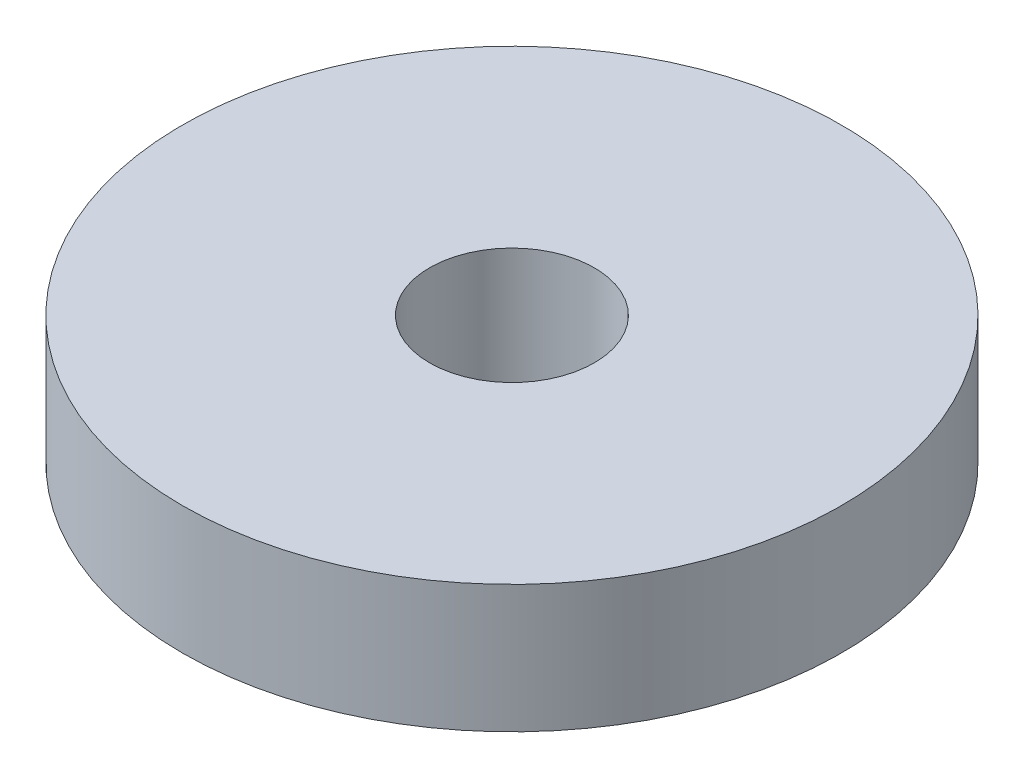
ISO-10303-21;
HEADER;
FILE_DESCRIPTION(('STEP AP214'),'2;1');
FILE_NAME('part.step','',(''),(''),'','','');
FILE_SCHEMA(('AUTOMOTIVE_DESIGN { 1 0 10303 214 1 1 1 1 }'));
ENDSEC;
DATA;
#1=APPLICATION_CONTEXT('core data for automotive mechanical design processes');
#2=APPLICATION_PROTOCOL_DEFINITION('international standard','automotive_design',2000,#1);
#3=PRODUCT_CONTEXT('',#1,'mechanical');
#4=PRODUCT('Part','Part','',(#3));
#5=PRODUCT_RELATED_PRODUCT_CATEGORY('part','',(#4));
#6=PRODUCT_DEFINITION_FORMATION('','',#4);
#7=PRODUCT_DEFINITION_CONTEXT('part definition',#1,'design');
#8=PRODUCT_DEFINITION('design','',#6,#7);
#9=PRODUCT_DEFINITION_SHAPE('','',#8);
#10=(LENGTH_UNIT() NAMED_UNIT(*) SI_UNIT(.MILLI.,.METRE.));
#11=(NAMED_UNIT(*) PLANE_ANGLE_UNIT() SI_UNIT($,.RADIAN.));
#12=(NAMED_UNIT(*) SI_UNIT($,.STERADIAN.) SOLID_ANGLE_UNIT());
#13=UNCERTAINTY_MEASURE_WITH_UNIT(LENGTH_MEASURE(1.E-05),#10,'distance_accuracy_value','');
#14=(GEOMETRIC_REPRESENTATION_CONTEXT(3) GLOBAL_UNCERTAINTY_ASSIGNED_CONTEXT((#13)) GLOBAL_UNIT_ASSIGNED_CONTEXT((#10,
#11,#12)) REPRESENTATION_CONTEXT('',''));
#15=CARTESIAN_POINT('',(0.,0.,0.));
#16=DIRECTION('',(0.,0.,1.));
#17=DIRECTION('',(1.,0.,0.));
#18=AXIS2_PLACEMENT_3D('',#15,#16,#17);
#19=CARTESIAN_POINT('',(0.,3.937,0.));
#20=DIRECTION('',(0.,1.,0.));
#21=DIRECTION('',(0.,0.,1.));
#22=AXIS2_PLACEMENT_3D('',#19,#20,#21);
#23=PLANE('',#22);
#24=CARTESIAN_POINT('',(0.,3.937,0.));
#25=DIRECTION('',(0.,1.,0.));
#26=DIRECTION('',(0.,0.,1.));
#27=AXIS2_PLACEMENT_3D('',#24,#25,#26);
#28=CIRCLE('',#27,10.16);
#29=CARTESIAN_POINT('',(0.,3.937,10.16));
#30=VERTEX_POINT('',#29);
#31=EDGE_CURVE('E10',#30,#30,#28,.T.);
#32=ORIENTED_EDGE('',*,*,#31,.T.);
#33=EDGE_LOOP('',(#32));
#34=FACE_BOUND('',#33,.T.);
#35=CARTESIAN_POINT('',(0.,3.937,0.));
#36=DIRECTION('',(0.,1.,0.));
#37=DIRECTION('',(0.,0.,1.));
#38=AXIS2_PLACEMENT_3D('',#35,#36,#37);
#39=CIRCLE('',#38,2.54);
#40=CARTESIAN_POINT('',(0.,3.937,2.54));
#41=VERTEX_POINT('',#40);
#42=EDGE_CURVE('E50',#41,#41,#39,.T.);
#43=ORIENTED_EDGE('',*,*,#42,.F.);
#44=EDGE_LOOP('',(#43));
#45=FACE_BOUND('',#44,.T.);
#46=ADVANCED_FACE('F37',(#34,#45),#23,.T.);
#47=CARTESIAN_POINT('',(0.,0.,0.));
#48=DIRECTION('',(0.,1.,0.));
#49=DIRECTION('',(0.,0.,1.));
#50=AXIS2_PLACEMENT_3D('',#47,#48,#49);
#51=PLANE('',#50);
#52=CARTESIAN_POINT('',(0.,0.,0.));
#53=DIRECTION('',(0.,1.,0.));
#54=DIRECTION('',(0.,0.,1.));
#55=AXIS2_PLACEMENT_3D('',#52,#53,#54);
#56=CIRCLE('',#55,10.16);
#57=CARTESIAN_POINT('',(0.,0.,10.16));
#58=VERTEX_POINT('',#57);
#59=EDGE_CURVE('E41',#58,#58,#56,.T.);
#60=ORIENTED_EDGE('',*,*,#59,.F.);
#61=EDGE_LOOP('',(#60));
#62=FACE_BOUND('',#61,.T.);
#63=CARTESIAN_POINT('',(0.,0.,0.));
#64=DIRECTION('',(0.,1.,0.));
#65=DIRECTION('',(0.,0.,1.));
#66=AXIS2_PLACEMENT_3D('',#63,#64,#65);
#67=CIRCLE('',#66,2.54);
#68=CARTESIAN_POINT('',(0.,0.,2.54));
#69=VERTEX_POINT('',#68);
#70=EDGE_CURVE('E52',#69,#69,#67,.T.);
#71=ORIENTED_EDGE('',*,*,#70,.T.);
#72=EDGE_LOOP('',(#71));
#73=FACE_BOUND('',#72,.T.);
#74=ADVANCED_FACE('F64',(#62,#73),#51,.F.);
#75=CARTESIAN_POINT('',(0.,3.937,0.));
#76=DIRECTION('',(0.,-1.,0.));
#77=DIRECTION('',(0.,0.,-1.));
#78=AXIS2_PLACEMENT_3D('',#75,#76,#77);
#79=CYLINDRICAL_SURFACE('',#78,10.16);
#80=ORIENTED_EDGE('',*,*,#31,.F.);
#81=EDGE_LOOP('',(#80));
#82=FACE_BOUND('',#81,.T.);
#83=ORIENTED_EDGE('',*,*,#59,.T.);
#84=EDGE_LOOP('',(#83));
#85=FACE_BOUND('',#84,.T.);
#86=ADVANCED_FACE('F39',(#82,#85),#79,.T.);
#87=CARTESIAN_POINT('',(0.,3.937,0.));
#88=DIRECTION('',(0.,-1.,0.));
#89=DIRECTION('',(0.,0.,-1.));
#90=AXIS2_PLACEMENT_3D('',#87,#88,#89);
#91=CYLINDRICAL_SURFACE('',#90,2.54);
#92=ORIENTED_EDGE('',*,*,#42,.T.);
#93=EDGE_LOOP('',(#92));
#94=FACE_BOUND('',#93,.T.);
#95=ORIENTED_EDGE('',*,*,#70,.F.);
#96=EDGE_LOOP('',(#95));
#97=FACE_BOUND('',#96,.T.);
#98=ADVANCED_FACE('F60',(#94,#97),#91,.F.);
#99=CLOSED_SHELL('',(#46,#74,#86,#98));
#100=MANIFOLD_SOLID_BREP('B2',#99);
#101=ADVANCED_BREP_SHAPE_REPRESENTATION('',(#18,#100),#14);
#102=SHAPE_DEFINITION_REPRESENTATION(#9,#101);
ENDSEC;
END-ISO-10303-21;
